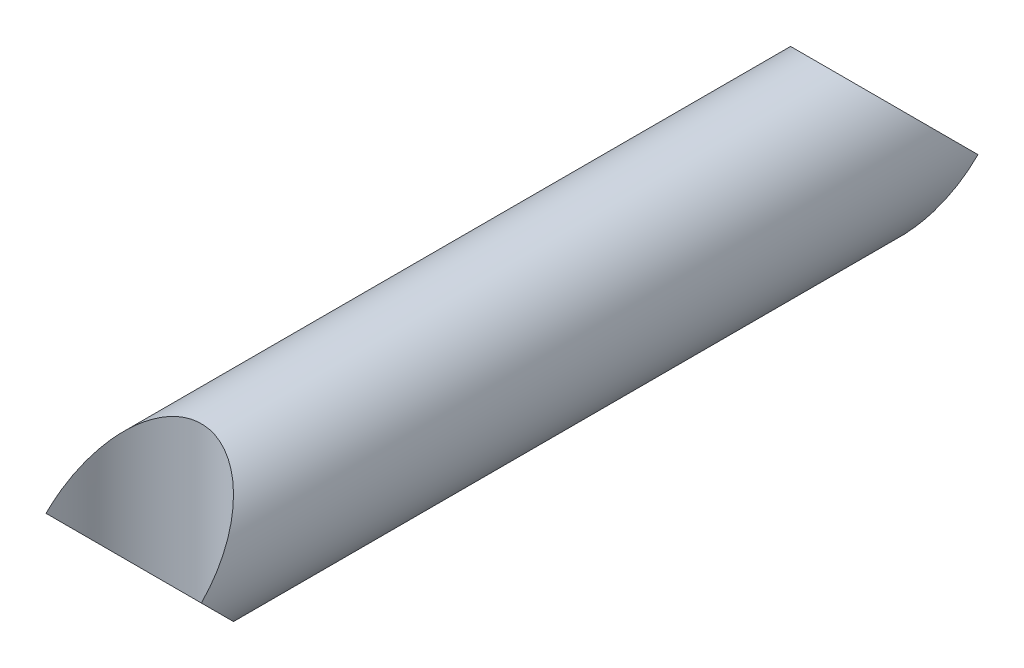
ISO-10303-21;
HEADER;
FILE_DESCRIPTION(('STEP AP214'),'2;1');
FILE_NAME('part.step','',(''),(''),'','','');
FILE_SCHEMA(('AUTOMOTIVE_DESIGN { 1 0 10303 214 1 1 1 1 }'));
ENDSEC;
DATA;
#1=APPLICATION_CONTEXT('core data for automotive mechanical design processes');
#2=APPLICATION_PROTOCOL_DEFINITION('international standard','automotive_design',2000,#1);
#3=PRODUCT_CONTEXT('',#1,'mechanical');
#4=PRODUCT('Part','Part','',(#3));
#5=PRODUCT_RELATED_PRODUCT_CATEGORY('part','',(#4));
#6=PRODUCT_DEFINITION_FORMATION('','',#4);
#7=PRODUCT_DEFINITION_CONTEXT('part definition',#1,'design');
#8=PRODUCT_DEFINITION('design','',#6,#7);
#9=PRODUCT_DEFINITION_SHAPE('','',#8);
#10=(LENGTH_UNIT() NAMED_UNIT(*) SI_UNIT(.MILLI.,.METRE.));
#11=(NAMED_UNIT(*) PLANE_ANGLE_UNIT() SI_UNIT($,.RADIAN.));
#12=(NAMED_UNIT(*) SI_UNIT($,.STERADIAN.) SOLID_ANGLE_UNIT());
#13=UNCERTAINTY_MEASURE_WITH_UNIT(LENGTH_MEASURE(1.E-05),#10,'distance_accuracy_value','');
#14=(GEOMETRIC_REPRESENTATION_CONTEXT(3) GLOBAL_UNCERTAINTY_ASSIGNED_CONTEXT((#13)) GLOBAL_UNIT_ASSIGNED_CONTEXT((#10,
#11,#12)) REPRESENTATION_CONTEXT('',''));
#15=CARTESIAN_POINT('',(0.,0.,0.));
#16=DIRECTION('',(0.,0.,1.));
#17=DIRECTION('',(1.,0.,0.));
#18=AXIS2_PLACEMENT_3D('',#15,#16,#17);
#19=CARTESIAN_POINT('',(0.,0.,0.));
#20=DIRECTION('',(0.,1.,0.));
#21=DIRECTION('',(0.,0.,1.));
#22=AXIS2_PLACEMENT_3D('',#19,#20,#21);
#23=CYLINDRICAL_SURFACE('',#22,25.4);
#24=CARTESIAN_POINT('',(-25.4,0.,0.));
#25=CARTESIAN_POINT('',(-25.3999920544221,-0.401226366646719,0.401039178056689));
#26=CARTESIAN_POINT('',(-25.3904941008682,-0.802374573381763,0.802174230327431));
#27=CARTESIAN_POINT('',(-25.3572330882322,-1.50375810014384,1.50363122073521));
#28=CARTESIAN_POINT('',(-25.3376381064272,-1.80410694524607,1.80404252288148));
#29=CARTESIAN_POINT('',(-25.3077535207798,-2.16359854457294,2.16358607004931));
#30=CARTESIAN_POINT('',(-25.3026090441571,-2.222954405143,2.22294976222645));
#31=CARTESIAN_POINT('',(-25.2719180694074,-2.5631362156659,2.56315818573231));
#32=CARTESIAN_POINT('',(-25.241881759591,-2.84380080800986,2.8437733489418));
#33=CARTESIAN_POINT('',(-25.1646841443686,-3.46666990563632,3.46659554770084));
#34=CARTESIAN_POINT('',(-25.1152026717676,-3.80872509137331,3.80866721001057));
#35=CARTESIAN_POINT('',(-25.0325906082402,-4.30753358355355,4.30751982238383));
#36=CARTESIAN_POINT('',(-25.0050279796697,-4.46476221564417,4.46476528782357));
#37=CARTESIAN_POINT('',(-24.9394746113279,-4.81900420953027,4.81900035427685));
#38=CARTESIAN_POINT('',(-24.9006165716204,-5.01594324617028,5.01590418935291));
#39=CARTESIAN_POINT('',(-24.7799952701596,-5.59119254620094,5.59100429534657));
#40=CARTESIAN_POINT('',(-24.6917778646727,-5.96885819433322,5.96851319571054));
#41=CARTESIAN_POINT('',(-24.5025901339955,-6.7021547341442,6.70162022542667));
#42=CARTESIAN_POINT('',(-24.402526757385,-7.0579060738627,7.05733275363946));
#43=CARTESIAN_POINT('',(-24.1921772225119,-7.74733494871354,7.74684762206255));
#44=CARTESIAN_POINT('',(-24.0827577926573,-8.08114896008624,8.08077754362327));
#45=CARTESIAN_POINT('',(-23.856080737492,-8.72683071210018,8.72669282922222));
#46=CARTESIAN_POINT('',(-23.7396509781816,-9.03884415132987,9.0388233987461));
#47=CARTESIAN_POINT('',(-23.4702742808389,-9.71927307479291,9.7192977611053));
#48=CARTESIAN_POINT('',(-23.3145887680235,-10.0871689449155,10.0870819394219));
#49=CARTESIAN_POINT('',(-22.9903546556834,-10.8052323133036,10.8049647630732));
#50=CARTESIAN_POINT('',(-22.8224885710403,-11.1555546415052,11.155216815527));
#51=CARTESIAN_POINT('',(-22.4756227923025,-11.8383864584989,11.838008511331));
#52=CARTESIAN_POINT('',(-22.2972888999455,-12.1710668494751,12.1707153406947));
#53=CARTESIAN_POINT('',(-21.9311507700362,-12.8186379761997,12.8184177792761));
#54=CARTESIAN_POINT('',(-21.7439959905821,-13.1337133678601,13.1335949147743));
#55=CARTESIAN_POINT('',(-21.454380682475,-13.5978469746312,13.5978223962244));
#56=CARTESIAN_POINT('',(-21.3579735979577,-13.7487899709509,13.7487869905234));
#57=CARTESIAN_POINT('',(-21.1498116500917,-14.0671882009044,14.0671915326823));
#58=CARTESIAN_POINT('',(-21.0375872773712,-14.2344923271426,14.234475724924));
#59=CARTESIAN_POINT('',(-20.6991679044976,-14.7261773214697,14.7260843251318));
#60=CARTESIAN_POINT('',(-20.4662941154893,-15.048285726513,15.0481195650655));
#61=CARTESIAN_POINT('',(-19.989813974462,-15.6753774454176,15.6751194520611));
#62=CARTESIAN_POINT('',(-19.746781924455,-15.9805799324607,15.9803016180997));
#63=CARTESIAN_POINT('',(-19.2512972606937,-16.5738357795373,16.5735952236773));
#64=CARTESIAN_POINT('',(-18.9994056684802,-16.8621243117728,16.8619393145228));
#65=CARTESIAN_POINT('',(-18.4874786399899,-17.4215987627873,17.4215311495354));
#66=CARTESIAN_POINT('',(-18.2279901074098,-17.6930348162483,17.6930287595357));
#67=CARTESIAN_POINT('',(-17.6822006352155,-18.2388233918833,18.2388296939127));
#68=CARTESIAN_POINT('',(-17.3952393999474,-18.5128487447329,18.5128012620619));
#69=CARTESIAN_POINT('',(-16.8120322726002,-19.043810957803,19.0436709360134));
#70=CARTESIAN_POINT('',(-16.5162658817233,-19.3010110718605,19.3008319195626));
#71=CARTESIAN_POINT('',(-15.9165402405606,-19.7982626953444,19.7980599799102));
#72=CARTESIAN_POINT('',(-15.6130418826086,-20.0385926776463,20.0384040295462));
#73=CARTESIAN_POINT('',(-14.9988987629603,-20.5021178631967,20.5019988006219));
#74=CARTESIAN_POINT('',(-14.6886950442086,-20.7256048741087,20.7255401528301));
#75=CARTESIAN_POINT('',(-14.2155006491587,-21.0502993429779,21.0502860074553));
#76=CARTESIAN_POINT('',(-14.0582144391698,-21.1556784752541,21.1556772724818));
#77=CARTESIAN_POINT('',(-13.7382045442355,-21.3648941518918,21.3648953685487));
#78=CARTESIAN_POINT('',(-13.5754390497533,-21.4686988455891,21.468690095118));
#79=CARTESIAN_POINT('',(-13.0874084246316,-21.7721096848621,21.7720614649144));
#80=CARTESIAN_POINT('',(-12.7568751204568,-21.9675175422954,21.9674302502039));
#81=CARTESIAN_POINT('',(-12.08961456149,-22.341533779065,22.3413970834665));
#82=CARTESIAN_POINT('',(-11.7532037258096,-22.5204248488147,22.5202771826104));
#83=CARTESIAN_POINT('',(-11.0750651323274,-22.8614020826823,22.8612735555597));
#84=CARTESIAN_POINT('',(-10.7336261249957,-23.0237752839107,23.0236759500831));
#85=CARTESIAN_POINT('',(-10.0463124266658,-23.3317445907824,23.3317083697096));
#86=CARTESIAN_POINT('',(-9.70069671756104,-23.4776292801617,23.4776268616387));
#87=CARTESIAN_POINT('',(-9.009996183127,-23.7510709377269,23.7510732771573));
#88=CARTESIAN_POINT('',(-8.66526362269101,-23.8790712537856,23.8790465677449));
#89=CARTESIAN_POINT('',(-7.97184532750376,-24.1193312343044,24.1192588230783));
#90=CARTESIAN_POINT('',(-7.62331223109336,-24.2318108616473,24.231717656));
#91=CARTESIAN_POINT('',(-6.92303959437303,-24.4410119310293,24.4409056267678));
#92=CARTESIAN_POINT('',(-6.57142557482194,-24.5379435330003,24.5378445039061));
#93=CARTESIAN_POINT('',(-5.8656919969552,-24.7160728760289,24.7160098721488));
#94=CARTESIAN_POINT('',(-5.51167220596505,-24.7974673811724,24.7974328327563));
#95=CARTESIAN_POINT('',(-4.97776077855498,-24.9081220047168,24.9081148864068));
#96=CARTESIAN_POINT('',(-4.80015345153614,-24.9429629873639,24.9429624743908));
#97=CARTESIAN_POINT('',(-4.45246947550754,-25.0073027857797,25.0073032731464));
#98=CARTESIAN_POINT('',(-4.28245946686129,-25.0369814536734,25.0369769290921));
#99=CARTESIAN_POINT('',(-3.77263338106798,-25.1206167328877,25.1205918379316));
#100=CARTESIAN_POINT('',(-3.43114130100647,-25.1695607257045,25.1695151420188));
#101=CARTESIAN_POINT('',(-2.74686599959355,-25.2533728456722,25.2533008534794));
#102=CARTESIAN_POINT('',(-2.40410309865979,-25.2883243640767,25.2882465622754));
#103=CARTESIAN_POINT('',(-1.71784659861864,-25.3441704706137,25.3441021214582));
#104=CARTESIAN_POINT('',(-1.37436318659347,-25.3651274557104,25.3650742743351));
#105=CARTESIAN_POINT('',(-0.687251006037886,-25.3930221155198,25.3930030116397));
#106=CARTESIAN_POINT('',(-0.343625506355488,-25.4000000000855,25.3999997950156));
#107=CARTESIAN_POINT('',(0.343619556791815,-25.3999999999145,25.4000002049807));
#108=CARTESIAN_POINT('',(0.687239120256489,-25.3930223568071,25.3930040738468));
#109=CARTESIAN_POINT('',(1.37434284785603,-25.3651285233238,25.3650762290606));
#110=CARTESIAN_POINT('',(1.71782373197874,-25.3441719860818,25.344104177292));
#111=CARTESIAN_POINT('',(2.40407859864625,-25.2883267047723,25.2882487365234));
#112=CARTESIAN_POINT('',(2.74684237182303,-25.2533754271025,25.2533029085506));
#113=CARTESIAN_POINT('',(3.43112279403248,-25.1695633069014,25.1695167319931));
#114=CARTESIAN_POINT('',(3.77261908994842,-25.1206189378744,25.1205929484564));
#115=CARTESIAN_POINT('',(4.28245277549438,-25.0369826215059,25.0369775239571));
#116=CARTESIAN_POINT('',(4.4524661405867,-25.0073034029288,25.0073036056407));
#117=CARTESIAN_POINT('',(4.80014990916624,-24.9429636428742,24.94296342952));
#118=CARTESIAN_POINT('',(4.9777537241279,-24.908123388272,24.90811686563));
#119=CARTESIAN_POINT('',(5.51165731120064,-24.7974706265384,24.7974372024359));
#120=CARTESIAN_POINT('',(5.86567275652604,-24.7160773767555,24.7160153578614));
#121=CARTESIAN_POINT('',(6.57140128022728,-24.5379500256386,24.5378514488998));
#122=CARTESIAN_POINT('',(6.92301451928196,-24.441019019657,24.4409127711766));
#123=CARTESIAN_POINT('',(7.62328908777704,-24.2318181839525,24.2317242804373));
#124=CARTESIAN_POINT('',(7.97182481464829,-24.1193380567294,24.1192645915269));
#125=CARTESIAN_POINT('',(8.66525181743968,-23.8790756338059,23.8790500045416));
#126=CARTESIAN_POINT('',(9.00999036663184,-23.7510732404542,23.7510751171234));
#127=CARTESIAN_POINT('',(9.70069059057685,-23.4776317057411,23.4776297656917));
#128=CARTESIAN_POINT('',(10.0463003672503,-23.3317496775728,23.3317143967003));
#129=CARTESIAN_POINT('',(10.7336058281815,-23.0237847022503,23.0236864109878));
#130=CARTESIAN_POINT('',(11.0750424096443,-22.8614130452328,22.8612851828392));
#131=CARTESIAN_POINT('',(11.7531796990697,-22.5204374031336,22.5202896335542));
#132=CARTESIAN_POINT('',(12.08959153162,-22.3415462565071,22.3414090675926));
#133=CARTESIAN_POINT('',(12.7568573465761,-21.9675279464625,21.9674396498875));
#134=CARTESIAN_POINT('',(13.0873947784563,-21.7721179715641,21.7720686327002));
#135=CARTESIAN_POINT('',(13.5754327411422,-21.4687028680504,21.4686935261471));
#136=CARTESIAN_POINT('',(13.738201425807,-21.3648961906494,21.3648971139815));
#137=CARTESIAN_POINT('',(14.0582112359889,-21.1556805694304,21.1556796566716));
#138=CARTESIAN_POINT('',(14.2154943149576,-21.0503035859205,21.0502908266149));
#139=CARTESIAN_POINT('',(14.6886818444298,-20.7256141428024,20.7255505221458));
#140=CARTESIAN_POINT('',(14.998881815644,-20.5021301737688,20.5020120883991));
#141=CARTESIAN_POINT('',(15.6130208343546,-20.0386090581945,20.0384209087367));
#142=CARTESIAN_POINT('',(15.9165186849252,-19.7982800050373,19.7980774269401));
#143=CARTESIAN_POINT('',(16.5162463448129,-19.301027849462,19.3008481478163));
#144=CARTESIAN_POINT('',(16.812015102917,-19.0438261771365,19.0436852824773));
#145=CARTESIAN_POINT('',(17.3952297372709,-18.5128579658158,18.5128096771047));
#146=CARTESIAN_POINT('',(17.6821959524479,-18.2388280744027,18.2388339815293));
#147=CARTESIAN_POINT('',(18.227985368191,-17.6930395556903,17.6930338787045));
#148=CARTESIAN_POINT('',(18.4874694390579,-17.4216083821967,17.4215415172386));
#149=CARTESIAN_POINT('',(18.9993905325288,-16.8621413045566,16.8619571654033));
#150=CARTESIAN_POINT('',(19.2512804854731,-16.5738552003355,16.5736152219644));
#151=CARTESIAN_POINT('',(19.7467645854746,-15.9806013796684,15.9803230734865));
#152=CARTESIAN_POINT('',(19.9897975442268,-15.6753984207215,15.6751401476806));
#153=CARTESIAN_POINT('',(20.4662817692704,-15.0483026448341,15.0481358186566));
#154=CARTESIAN_POINT('',(20.6991585607657,-14.7261905851126,14.7260968338971));
#155=CARTESIAN_POINT('',(21.0375830374797,-14.23449864682,14.2344816412116));
#156=CARTESIAN_POINT('',(21.1498095750852,-14.0671913747463,14.0671945067346));
#157=CARTESIAN_POINT('',(21.357971565744,-13.7487930793864,13.7487902777905));
#158=CARTESIAN_POINT('',(21.4543766949187,-13.5978532169786,13.5978289946591));
#159=CARTESIAN_POINT('',(21.7439878233426,-13.1337267620585,13.1336089987671));
#160=CARTESIAN_POINT('',(21.9311404408376,-12.8186555169402,12.8184359437065));
#161=CARTESIAN_POINT('',(22.2972764690322,-12.1710895932422,12.1707384424045));
#162=CARTESIAN_POINT('',(22.4756102627303,-11.8384102158346,11.8380324224707));
#163=CARTESIAN_POINT('',(22.8224776255333,-11.1555771324992,11.1552390720406));
#164=CARTESIAN_POINT('',(22.9903452255652,-10.8052524804741,10.8049845136734));
#165=CARTESIAN_POINT('',(23.3145837103588,-10.0871808902602,10.0870934795914));
#166=CARTESIAN_POINT('',(23.470271905405,-9.71927907485156,9.71930356438234));
#167=CARTESIAN_POINT('',(23.7396487297619,-9.03884983081756,9.03882924436888));
#168=CARTESIAN_POINT('',(23.8560764792206,-8.72684211877108,8.72670456660897));
#169=CARTESIAN_POINT('',(24.0827511277337,-8.08116871237553,8.08079769379407));
#170=CARTESIAN_POINT('',(24.1921700267753,-7.74735730399484,7.74687026115021));
#171=CARTESIAN_POINT('',(24.402519760985,-7.05793030542051,7.05735706016708));
#172=CARTESIAN_POINT('',(24.5025837219882,-6.70217821415256,6.70164368881527));
#173=CARTESIAN_POINT('',(24.6917734273057,-5.96887684228171,5.96853162910108));
#174=CARTESIAN_POINT('',(24.7799920615839,-5.59120709429559,5.59101852299903));
#175=CARTESIAN_POINT('',(24.9006152319549,-5.01595002676447,5.0159108948844));
#176=CARTESIAN_POINT('',(24.9394740015835,-4.81900748897921,4.81900371471388));
#177=CARTESIAN_POINT('',(25.0050268983043,-4.46476807158046,4.4647710790598));
#178=CARTESIAN_POINT('',(25.0325885318964,-4.30754545013485,4.307531411203));
#179=CARTESIAN_POINT('',(25.1151998989604,-3.80874328800521,3.80868626667207));
#180=CARTESIAN_POINT('',(25.1646819843244,-3.46668623790526,3.46661621427589));
#181=CARTESIAN_POINT('',(25.2418795767537,-2.84381931701471,2.84378826144852));
#182=CARTESIAN_POINT('',(25.2719153593183,-2.56315613858513,2.56316569402689));
#183=CARTESIAN_POINT('',(25.3296804930779,-1.92290472323423,1.92289249547965));
#184=CARTESIAN_POINT('',(25.3544156616708,-1.56319520228275,1.56308859721084));
#185=CARTESIAN_POINT('',(25.3904919203196,-0.802392367637315,0.80217641492752));
#186=CARTESIAN_POINT('',(25.3999876104842,-0.401249725766488,0.401029065841664));
#187=CARTESIAN_POINT('',(25.4,0.,0.));
#188=B_SPLINE_CURVE_WITH_KNOTS('',3,(#24,#25,#26,#27,#28,#29,#30,#31,#32,#33,#34,#35,#36,#37,
#38,#39,#40,#41,#42,#43,#44,#45,#46,#47,#48,#49,#50,#51,#52,#53,#54,#55,#56,#57,#58,#59,#60,#61,
#62,#63,#64,#65,#66,#67,#68,#69,#70,#71,#72,#73,#74,#75,#76,#77,#78,#79,#80,#81,#82,#83,#84,#85,
#86,#87,#88,#89,#90,#91,#92,#93,#94,#95,#96,#97,#98,#99,#100,#101,#102,#103,#104,#105,#106,#107,
#108,#109,#110,#111,#112,#113,#114,#115,#116,#117,#118,#119,#120,#121,#122,#123,#124,#125,#126,
#127,#128,#129,#130,#131,#132,#133,#134,#135,#136,#137,#138,#139,#140,#141,#142,#143,#144,#145,
#146,#147,#148,#149,#150,#151,#152,#153,#154,#155,#156,#157,#158,#159,#160,#161,#162,#163,#164,
#165,#166,#167,#168,#169,#170,#171,#172,#173,#174,#175,#176,#177,#178,#179,#180,#181,#182,#183,
#184,#185,#186,#187),.UNSPECIFIED.,.F.,.F.,(4,2,2,2,2,2,2,2,2,2,2,2,2,2,2,2,2,2,2,2,2,2,2,2,2,2,
2,2,2,2,2,2,2,2,2,2,2,2,2,2,2,2,2,2,2,2,2,2,2,2,2,2,2,2,2,2,2,2,2,2,2,2,2,2,2,2,2,2,2,2,2,2,2,2,
2,2,2,2,2,2,2,4),(0.,1.70179878460543,2.97741601134251,3.22973056918352,4.42367138610336,
5.88226719163596,6.55445590346961,7.39798015703908,9.02133552412731,10.5598876046845,
12.013690104342,13.3828069028239,15.0114448281328,16.5802615763926,18.0894418868126,
19.5391933408775,20.2418822757525,21.0274083148395,22.5616352518738,24.0472231500794,
25.4846384670989,26.8743961809247,28.3204436965788,29.7263132890715,31.092840604397,
32.4209355580073,33.0709247923643,33.7284174683614,35.020272086095,36.2824680466236,
37.5163379897057,38.7233083856976,39.8908074939667,41.0395382596947,42.1711219504659,
43.2872545588018,43.8401351843384,44.365417460784,45.4101150360922,46.4484903518031,
47.482204422146,48.5129407961542,49.5436593238979,50.5773657310422,51.6157436019079,
52.6604539364142,53.1857464015395,53.7386158813532,54.854734533448,55.9863154299089,
57.1350545751155,58.3025732005432,59.5095220385962,60.7433827288704,62.0055817745463,
63.2974518062951,63.9549568010057,64.604932530369,65.9330105892657,67.2995345237732,
68.7054142574681,70.1514854194877,71.5412178517152,72.9786223283838,74.4642138404631,
75.998458843348,76.7839993324185,77.4866733940747,78.9364062544267,80.4455828456241,
82.0144107513962,83.6430747075874,85.0121661448686,86.4659577747627,88.0045134786166,
89.6278869617365,90.4714257091774,91.143589733006,92.6021784853735,93.7961510426243,
95.324034714158,97.0258575972684),.UNSPECIFIED.);
#189=CARTESIAN_POINT('',(-25.4,0.,0.));
#190=VERTEX_POINT('',#189);
#191=CARTESIAN_POINT('',(25.4,0.,0.));
#192=VERTEX_POINT('',#191);
#193=EDGE_CURVE('E40',#190,#192,#188,.T.);
#194=ORIENTED_EDGE('',*,*,#193,.F.);
#195=CARTESIAN_POINT('',(25.4,0.,0.));
#196=CARTESIAN_POINT('',(25.3999920544238,0.401226363266249,0.401039174707697));
#197=CARTESIAN_POINT('',(25.3904941010281,0.802374566649201,0.802174223601833));
#198=CARTESIAN_POINT('',(25.3572330887337,1.50375809208906,1.50363121265583));
#199=CARTESIAN_POINT('',(25.3376381068805,1.80410693921546,1.80404251681745));
#200=CARTESIAN_POINT('',(25.3077535210122,2.16359854189143,2.16358606735792));
#201=CARTESIAN_POINT('',(25.302609044278,2.22295440380238,2.22294976088103));
#202=CARTESIAN_POINT('',(25.271918069579,2.56313621376462,2.56315818385304));
#203=CARTESIAN_POINT('',(25.2418817599978,2.84380080421113,2.84377334518474));
#204=CARTESIAN_POINT('',(25.1646841450988,3.46666990037707,3.46659554248614));
#205=CARTESIAN_POINT('',(25.1152026725048,3.8087250865505,3.8086672052072));
#206=CARTESIAN_POINT('',(25.0325906087531,4.3075335806282,4.30751981946052));
#207=CARTESIAN_POINT('',(25.00502797994,4.46476221418357,4.46476528636242));
#208=CARTESIAN_POINT('',(24.9394746113053,4.81900420965243,4.81900035439972));
#209=CARTESIAN_POINT('',(24.9006165715728,5.01594324641162,5.01590418960113));
#210=CARTESIAN_POINT('',(24.7799952700474,5.59119254670869,5.59100429587677));
#211=CARTESIAN_POINT('',(24.6917778645166,5.96885819498889,5.96851319639575));
#212=CARTESIAN_POINT('',(24.5025901337693,6.70215473497277,6.70162022629761));
#213=CARTESIAN_POINT('',(24.4025267571383,7.05790607471701,7.05733275454188));
#214=CARTESIAN_POINT('',(24.1921772222585,7.74733494950085,7.74684762290359));
#215=CARTESIAN_POINT('',(24.0827577924228,8.0811489607815,8.08077754437239));
#216=CARTESIAN_POINT('',(23.8560807373421,8.72683071250178,8.72669282965858));
#217=CARTESIAN_POINT('',(23.7396509781023,9.03884415153019,9.03882339896308));
#218=CARTESIAN_POINT('',(23.4702742806743,9.71927307520856,9.71929776150116));
#219=CARTESIAN_POINT('',(23.3145887676736,10.0871689457419,10.0870819402103));
#220=CARTESIAN_POINT('',(22.9903546550313,10.8052323146983,10.8049647644232));
#221=CARTESIAN_POINT('',(22.8224885702833,11.1555546430605,11.1552168170482));
#222=CARTESIAN_POINT('',(22.4756227914361,11.8383864601418,11.8380085129654));
#223=CARTESIAN_POINT('',(22.2972888990859,12.1710668510479,12.1707153422739));
#224=CARTESIAN_POINT('',(21.9311507693218,12.8186379774129,12.8184177805173));
#225=CARTESIAN_POINT('',(21.7439959900169,13.133713368787,13.1335949157361));
#226=CARTESIAN_POINT('',(21.4543806821994,13.5978469750627,13.5978223966756));
#227=CARTESIAN_POINT('',(21.3579735978175,13.7487899711654,13.7487869907487));
#228=CARTESIAN_POINT('',(21.1498116501156,14.0671882008679,14.0671915326336));
#229=CARTESIAN_POINT('',(21.0375872774192,14.234492327071,14.2344757248256));
#230=CARTESIAN_POINT('',(20.6991679046015,14.7261773213223,14.7260843249191));
#231=CARTESIAN_POINT('',(20.4662941156275,15.0482857263234,15.0481195647915));
#232=CARTESIAN_POINT('',(19.9898139746472,15.6753774451812,15.6751194517142));
#233=CARTESIAN_POINT('',(19.7467819246503,15.980579932219,15.9803016177401));
#234=CARTESIAN_POINT('',(19.2512972608823,16.573835779319,16.5735952233411));
#235=CARTESIAN_POINT('',(18.9994056686495,16.8621243115825,16.8619393142215));
#236=CARTESIAN_POINT('',(18.4874786400928,17.4215987626798,17.4215311493596));
#237=CARTESIAN_POINT('',(18.2279901074631,17.693034816195,17.6930287594489));
#238=CARTESIAN_POINT('',(17.6822006353421,18.2388233917566,18.2388296938209));
#239=CARTESIAN_POINT('',(17.3952394002081,18.5128487444841,18.5128012618817));
#240=CARTESIAN_POINT('',(16.8120322730623,19.0438109573933,19.0436709357051));
#241=CARTESIAN_POINT('',(16.5162658822489,19.3010110714092,19.3008319192128));
#242=CARTESIAN_POINT('',(15.9165402411399,19.7982626948791,19.7980599795335));
#243=CARTESIAN_POINT('',(15.6130418831743,20.0385926772061,20.0384040291818));
#244=CARTESIAN_POINT('',(14.9988987634164,20.5021178628653,20.5019988003366));
#245=CARTESIAN_POINT('',(14.6886950445649,20.7256048738586,20.7255401526091));
#246=CARTESIAN_POINT('',(14.2155006493286,21.0502993428641,21.0502860073508));
#247=CARTESIAN_POINT('',(14.0582144392553,21.1556784751982,21.1556772724294));
#248=CARTESIAN_POINT('',(13.7382045441427,21.3648941519525,21.3648953686058));
#249=CARTESIAN_POINT('',(13.5754390495665,21.4686988457082,21.4686900952323));
#250=CARTESIAN_POINT('',(13.0874084242291,21.7721096851065,21.7720614651567));
#251=CARTESIAN_POINT('',(12.7568751199318,21.9675175426028,21.9674302505196));
#252=CARTESIAN_POINT('',(12.0896145608089,22.341533779434,22.3413970838676));
#253=CARTESIAN_POINT('',(11.7532037250991,22.520424849186,22.5202771830271));
#254=CARTESIAN_POINT('',(11.0750651316555,22.8614020830064,22.8612735559493));
#255=CARTESIAN_POINT('',(10.7336261243957,23.0237752841892,23.0236759504338));
#256=CARTESIAN_POINT('',(10.0463124263094,23.3317445909328,23.3317083699125));
#257=CARTESIAN_POINT('',(9.70069671737996,23.4776292802334,23.4776268617374));
#258=CARTESIAN_POINT('',(9.00999618297573,23.7510709377868,23.7510732771911));
#259=CARTESIAN_POINT('',(8.66526362238398,23.8790712538995,23.8790465678054));
#260=CARTESIAN_POINT('',(7.97184532697079,24.1193312344817,24.1192588231793));
#261=CARTESIAN_POINT('',(7.62331223049237,24.2318108618374,24.2317176561179));
#262=CARTESIAN_POINT('',(6.92303959372226,24.4410119312133,24.4409056268958));
#263=CARTESIAN_POINT('',(6.57142557419145,24.5379435331688,24.5378445040308));
#264=CARTESIAN_POINT('',(5.8656919964558,24.7160728761458,24.7160098722463));
#265=CARTESIAN_POINT('',(5.51167220557828,24.7974673812567,24.7974328328335));
#266=CARTESIAN_POINT('',(4.97776077837211,24.9081220047526,24.9081148864427));
#267=CARTESIAN_POINT('',(4.80015345144444,24.9429629873809,24.9429624744083));
#268=CARTESIAN_POINT('',(4.45246947550158,25.0073027857808,25.007303273147));
#269=CARTESIAN_POINT('',(4.28245946684916,25.0369814536755,25.0369769290922));
#270=CARTESIAN_POINT('',(3.77263338104189,25.1206167328917,25.1205918379306));
#271=CARTESIAN_POINT('',(3.43114130097278,25.1695607257092,25.1695151420183));
#272=CARTESIAN_POINT('',(2.7468659995506,25.2533728456769,25.2533008534791));
#273=CARTESIAN_POINT('',(2.40410309861526,25.2883243640809,25.2882465622752));
#274=CARTESIAN_POINT('',(1.71784659857707,25.3441704706164,25.3441021214579));
#275=CARTESIAN_POINT('',(1.3743631865565,25.3651274557123,25.3650742743349));
#276=CARTESIAN_POINT('',(0.687251006016288,25.3930221155203,25.3930030116397));
#277=CARTESIAN_POINT('',(0.343625506344687,25.4000000000855,25.3999997950158));
#278=CARTESIAN_POINT('',(-0.343619556763471,25.3999999999145,25.4000002049805));
#279=CARTESIAN_POINT('',(-0.687239120199795,25.3930223568083,25.3930040738464));
#280=CARTESIAN_POINT('',(-1.37434284775896,25.3651285233289,25.3650762290603));
#281=CARTESIAN_POINT('',(-1.71782373186959,25.344171986089,25.3441041772913));
#282=CARTESIAN_POINT('',(-2.40407859852929,25.2883267047835,25.2882487365228));
#283=CARTESIAN_POINT('',(-2.74684237171023,25.2533754271149,25.2533029085498));
#284=CARTESIAN_POINT('',(-3.43112279394402,25.1695633069137,25.1695167319919));
#285=CARTESIAN_POINT('',(-3.77261908987998,25.120618937885,25.1205929484543));
#286=CARTESIAN_POINT('',(-4.28245277546247,25.0369826215115,25.0369775239572));
#287=CARTESIAN_POINT('',(-4.45246614057091,25.0073034029317,25.0073036056416));
#288=CARTESIAN_POINT('',(-4.80014990902189,24.9429636429009,24.9429634295489));
#289=CARTESIAN_POINT('',(-4.97775372384006,24.9081233883284,24.908116865689));
#290=CARTESIAN_POINT('',(-5.51165731059196,24.797470626671,24.7974372025633));
#291=CARTESIAN_POINT('',(-5.86567275574009,24.7160773769393,24.7160153580222));
#292=CARTESIAN_POINT('',(-6.57140127923502,24.5379500259037,24.5378514491052));
#293=CARTESIAN_POINT('',(-6.92301451825779,24.4410190199466,24.4409127713876));
#294=CARTESIAN_POINT('',(-7.62328908683133,24.2318181842517,24.2317242806318));
#295=CARTESIAN_POINT('',(-7.97182481380969,24.1193380570084,24.1192645916942));
#296=CARTESIAN_POINT('',(-8.66525181695653,23.8790756339851,23.8790500046413));
#297=CARTESIAN_POINT('',(-9.00999036639356,23.7510732405485,23.7510751171781));
#298=CARTESIAN_POINT('',(-9.70069059035269,23.4776317058299,23.4776297658214));
#299=CARTESIAN_POINT('',(-10.0463003668096,23.3317496777586,23.3317143969678));
#300=CARTESIAN_POINT('',(-10.7336058274399,23.0237847025945,23.0236864114497));
#301=CARTESIAN_POINT('',(-11.0750424088134,22.8614130456336,22.861285183352));
#302=CARTESIAN_POINT('',(-11.753179698191,22.5204374035927,22.5202896341025));
#303=CARTESIAN_POINT('',(-12.0895915307779,22.3415462569634,22.3414090681205));
#304=CARTESIAN_POINT('',(-12.756857345927,21.9675279468425,21.9674396503032));
#305=CARTESIAN_POINT('',(-13.0873947779588,21.7721179718662,21.7720686330194));
#306=CARTESIAN_POINT('',(-13.5754327409113,21.4687028681976,21.4686935262975));
#307=CARTESIAN_POINT('',(-13.7382014256926,21.3648961907242,21.3648971140571));
#308=CARTESIAN_POINT('',(-14.0582112359886,21.1556805694306,21.155679656671));
#309=CARTESIAN_POINT('',(-14.2154943149574,21.0503035859206,21.0502908266147));
#310=CARTESIAN_POINT('',(-14.68868184443,20.7256141428023,20.7255505221462));
#311=CARTESIAN_POINT('',(-14.998881815644,20.5021301737688,20.5020120883992));
#312=CARTESIAN_POINT('',(-15.6130208343546,20.0386090581945,20.0384209087366));
#313=CARTESIAN_POINT('',(-15.9165186849253,19.7982800050372,19.7980774269403));
#314=CARTESIAN_POINT('',(-16.5162463448128,19.3010278494621,19.3008481478162));
#315=CARTESIAN_POINT('',(-16.8120151029166,19.043826177137,19.0436852824765));
#316=CARTESIAN_POINT('',(-17.3952297372713,18.5128579658154,18.5128096771056));
#317=CARTESIAN_POINT('',(-17.6821959524496,18.2388280744011,18.2388339815325));
#318=CARTESIAN_POINT('',(-18.2279853679103,17.693039555971,17.6930338789805));
#319=CARTESIAN_POINT('',(-18.4874694385105,17.4216083827691,17.4215415177938));
#320=CARTESIAN_POINT('',(-18.9993905316276,16.8621413055681,16.8619571663589));
#321=CARTESIAN_POINT('',(-19.2512804844755,16.5738552014905,16.5736152230369));
#322=CARTESIAN_POINT('',(-19.7467645844441,15.9806013809431,15.9803230746386));
#323=CARTESIAN_POINT('',(-19.9897975432503,15.6753984219682,15.6751401487918));
#324=CARTESIAN_POINT('',(-20.4662817685356,15.0483026458409,15.0481358195275));
#325=CARTESIAN_POINT('',(-20.6991585602088,14.7261905859033,14.7260968345653));
#326=CARTESIAN_POINT('',(-21.037583037228,14.2344986471951,14.2344816415301));
#327=CARTESIAN_POINT('',(-21.1498095749625,14.067191374934,14.0671945068959));
#328=CARTESIAN_POINT('',(-21.3579715653936,13.7487930799225,13.7487902783503));
#329=CARTESIAN_POINT('',(-21.4543766942303,13.5978532180563,13.5978289957813));
#330=CARTESIAN_POINT('',(-21.7439878219312,13.1337267643731,13.1336090011593));
#331=CARTESIAN_POINT('',(-21.9311404390534,12.8186555199701,12.8184359467935));
#332=CARTESIAN_POINT('',(-22.2972764668855,12.1710895971698,12.1707384463321));
#333=CARTESIAN_POINT('',(-22.4756102605667,11.838410219937,11.8380324265361));
#334=CARTESIAN_POINT('',(-22.8224776236428,11.1555771363838,11.1552390758237));
#335=CARTESIAN_POINT('',(-22.990345223936,10.8052524839584,10.8049845170293));
#336=CARTESIAN_POINT('',(-23.3145837094854,10.0871808923227,10.0870934815537));
#337=CARTESIAN_POINT('',(-23.4702719049961,9.71927907588423,9.71930356537292));
#338=CARTESIAN_POINT('',(-23.7396487289854,9.03884983277923,9.03882924636615));
#339=CARTESIAN_POINT('',(-23.8560764777484,8.72684212271525,8.72670457061471));
#340=CARTESIAN_POINT('',(-24.082751125429,8.08116871920518,8.08079770066982));
#341=CARTESIAN_POINT('',(-24.192170024288,7.74735731172141,7.74687026887723));
#342=CARTESIAN_POINT('',(-24.4025197585662,7.05793031379865,7.05735706846428));
#343=CARTESIAN_POINT('',(-24.5025837197705,6.70217822227691,6.70164369682425));
#344=CARTESIAN_POINT('',(-24.6917734257729,5.96887684872054,5.96853163539262));
#345=CARTESIAN_POINT('',(-24.7799920604797,5.59120709929415,5.59101852785528));
#346=CARTESIAN_POINT('',(-24.9006152314891,5.01595002912466,5.01591089717301));
#347=CARTESIAN_POINT('',(-24.9394740013648,4.81900749016082,4.8190037158593));
#348=CARTESIAN_POINT('',(-25.0050268984168,4.46476807097263,4.46477107848083));
#349=CARTESIAN_POINT('',(-25.0325885321097,4.30754544891783,4.30753141004427));
#350=CARTESIAN_POINT('',(-25.1151998992694,3.80874328598466,3.8086862647826));
#351=CARTESIAN_POINT('',(-25.1646819846297,3.46668623570271,3.46661621222361));
#352=CARTESIAN_POINT('',(-25.2418795769232,2.84381931543389,2.84378825995984));
#353=CARTESIAN_POINT('',(-25.2719153593893,2.56315613780153,2.56316569327484));
#354=CARTESIAN_POINT('',(-25.3296804936815,1.92290471654034,1.92289248874509));
#355=CARTESIAN_POINT('',(-25.3544156625937,1.56319518885936,1.56308858375011));
#356=CARTESIAN_POINT('',(-25.3904919206391,0.802392354182075,0.802176401468014));
#357=CARTESIAN_POINT('',(-25.3999876104867,0.401249719024789,0.401029059124405));
#358=CARTESIAN_POINT('',(-25.4,0.,0.));
#359=B_SPLINE_CURVE_WITH_KNOTS('',3,(#195,#196,#197,#198,#199,#200,#201,#202,#203,#204,#205,
#206,#207,#208,#209,#210,#211,#212,#213,#214,#215,#216,#217,#218,#219,#220,#221,#222,#223,#224,
#225,#226,#227,#228,#229,#230,#231,#232,#233,#234,#235,#236,#237,#238,#239,#240,#241,#242,#243,
#244,#245,#246,#247,#248,#249,#250,#251,#252,#253,#254,#255,#256,#257,#258,#259,#260,#261,#262,
#263,#264,#265,#266,#267,#268,#269,#270,#271,#272,#273,#274,#275,#276,#277,#278,#279,#280,#281,
#282,#283,#284,#285,#286,#287,#288,#289,#290,#291,#292,#293,#294,#295,#296,#297,#298,#299,#300,
#301,#302,#303,#304,#305,#306,#307,#308,#309,#310,#311,#312,#313,#314,#315,#316,#317,#318,#319,
#320,#321,#322,#323,#324,#325,#326,#327,#328,#329,#330,#331,#332,#333,#334,#335,#336,#337,#338,
#339,#340,#341,#342,#343,#344,#345,#346,#347,#348,#349,#350,#351,#352,#353,#354,#355,#356,#357,
#358),.UNSPECIFIED.,.F.,.F.,(4,2,2,2,2,2,2,2,2,2,2,2,2,2,2,2,2,2,2,2,2,2,2,2,2,2,2,2,2,2,2,2,2,
2,2,2,2,2,2,2,2,2,2,2,2,2,2,2,2,2,2,2,2,2,2,2,2,2,2,2,2,2,2,2,2,2,2,2,2,2,2,2,2,2,2,2,2,2,2,2,2,
4),(0.,1.70179877033373,2.97741600563434,3.22973056918481,4.42367137806844,5.88226718538682,
6.55445590347123,7.39798015756481,9.02133552530805,10.5598876059962,12.0136901052608,
13.3828069028262,15.0114448299258,16.5802615789532,18.0894418891173,19.5391933419029,
20.2418822757545,21.0274083146476,22.5616352514399,24.0472231495973,25.484638466761,
26.8743961809218,28.3204436959782,29.7263132882139,31.0928406036253,32.4209355576656,
33.0709247923669,33.7284174687377,35.0202720869384,36.2824680475604,37.5163379903629,
38.7233083857045,39.8908074944666,41.0395382604069,42.171121951107,43.2872545590874,
43.8401351843392,44.365417460803,45.4101150361342,46.4484903518497,47.4822044221788,
48.5129407961546,49.5436593238132,50.5773657309212,51.615743601799,52.6604539363654,
53.1857464015386,53.7386158809036,54.8547345324374,55.9863154287865,57.135054574328,
58.3025732005339,59.5095220377738,60.7433827276982,62.005581773491,63.2974518058252,
63.9549568010045,64.6049325303677,65.9330105892645,67.2995345237719,68.7054142574669,
70.1514854194865,71.5412178502637,72.978622326311,74.4642138385973,75.9984588425159,
76.7839993324127,77.4866733915176,78.9364062486804,80.4455828392398,82.0144107469254,
83.6430747075805,85.012166136147,86.4659577623062,88.004513467405,89.6278869567493,
90.47142570917,91.1435897355386,92.6021784886316,93.7961510426173,95.3240347426929,
97.0258575972621),.UNSPECIFIED.);
#360=EDGE_CURVE('E43',#192,#190,#359,.T.);
#361=ORIENTED_EDGE('',*,*,#360,.F.);
#362=EDGE_LOOP('',(#194,#361));
#363=FACE_BOUND('',#362,.T.);
#364=ADVANCED_FACE('F17',(#363),#23,.F.);
#365=CARTESIAN_POINT('',(0.,0.,254.));
#366=DIRECTION('',(0.,1.,0.));
#367=DIRECTION('',(0.,0.,1.));
#368=AXIS2_PLACEMENT_3D('',#365,#366,#367);
#369=CYLINDRICAL_SURFACE('',#368,25.4);
#370=CARTESIAN_POINT('',(0.,0.,254.));
#371=DIRECTION('',(0.,0.707106781186547,0.707106781186547));
#372=DIRECTION('',(0.,0.707106781186547,-0.707106781186547));
#373=AXIS2_PLACEMENT_3D('',#370,#371,#372);
#374=ELLIPSE('',#373,35.9210244842766,25.4);
#375=CARTESIAN_POINT('',(-25.4,0.,254.));
#376=VERTEX_POINT('',#375);
#377=CARTESIAN_POINT('',(25.4,0.,254.));
#378=VERTEX_POINT('',#377);
#379=EDGE_CURVE('E11',#376,#378,#374,.F.);
#380=ORIENTED_EDGE('',*,*,#379,.F.);
#381=CARTESIAN_POINT('',(25.4,0.,254.));
#382=CARTESIAN_POINT('',(25.3999920544338,-0.401226343417553,253.598960844951));
#383=CARTESIAN_POINT('',(25.3904941019672,-0.802374527122536,253.197825815882));
#384=CARTESIAN_POINT('',(25.3572330916777,-1.50375804480183,252.496368834777));
#385=CARTESIAN_POINT('',(25.3376381095413,-1.80410690381238,252.195957518785));
#386=CARTESIAN_POINT('',(25.3077535223767,-2.16359852614855,251.836413948442));
#387=CARTESIAN_POINT('',(25.3026090449882,-2.22295439593122,251.777050247017));
#388=CARTESIAN_POINT('',(25.2719180717812,-2.56313618935483,251.436841840435));
#389=CARTESIAN_POINT('',(25.2418817652177,-2.84380075545322,251.156226703385));
#390=CARTESIAN_POINT('',(25.1646841544662,-3.46666983291065,250.533404524966));
#391=CARTESIAN_POINT('',(25.1152026819584,-3.80872502469484,250.191332856937));
#392=CARTESIAN_POINT('',(25.0325906153374,-4.30753354307252,249.692480218323));
#393=CARTESIAN_POINT('',(25.00502798341,-4.46476219543227,249.535234732523));
#394=CARTESIAN_POINT('',(24.9394746121604,-4.8190042050314,249.180999650053));
#395=CARTESIAN_POINT('',(24.9006165734018,-5.01594323714413,248.984095819257));
#396=CARTESIAN_POINT('',(24.7799952743916,-5.59119252703942,248.408995722875));
#397=CARTESIAN_POINT('',(24.6917778705436,-5.96885816967249,248.031486827919));
#398=CARTESIAN_POINT('',(24.502590142485,-6.70215470304401,247.298379804671));
#399=CARTESIAN_POINT('',(24.402526766645,-7.05790604178863,246.942667277538));
#400=CARTESIAN_POINT('',(24.1921772320359,-7.74733491912734,246.253152406965));
#401=CARTESIAN_POINT('',(24.0827578014852,-8.08114893392777,245.919222482199));
#402=CARTESIAN_POINT('',(23.8560807431298,-8.72683069699477,245.273307185823));
#403=CARTESIAN_POINT('',(23.739650981153,-9.03884414382352,244.961176608762));
#404=CARTESIAN_POINT('',(23.4702742810293,-9.71927307431264,244.280702239373));
#405=CARTESIAN_POINT('',(23.314588768448,-10.087168943914,243.912918061479));
#406=CARTESIAN_POINT('',(22.9903546564813,-10.8052323115959,243.195035238449));
#407=CARTESIAN_POINT('',(22.8224885719638,-11.1555546396073,242.844783186196));
#408=CARTESIAN_POINT('',(22.4756227933577,-11.8383864564985,242.161991490525));
#409=CARTESIAN_POINT('',(22.2972889009931,-12.1710668475587,241.829284661097));
#410=CARTESIAN_POINT('',(21.9311507709076,-12.8186379747195,241.18158222213));
#411=CARTESIAN_POINT('',(21.7439959912723,-13.1337133667284,240.866405086314));
#412=CARTESIAN_POINT('',(21.4543806828107,-13.5978469741057,240.402177604288));
#413=CARTESIAN_POINT('',(21.3579735981286,-13.7487899706896,240.251213009732));
#414=CARTESIAN_POINT('',(21.1498116501246,-14.067188200854,239.932808467375));
#415=CARTESIAN_POINT('',(21.037587277439,-14.2344923270415,239.765524275188));
#416=CARTESIAN_POINT('',(20.6991679046468,-14.726177321258,239.273915675107));
#417=CARTESIAN_POINT('',(20.4662941156865,-15.0482857262426,238.951880435245));
#418=CARTESIAN_POINT('',(19.9898139747251,-15.6753774450818,238.324880548333));
#419=CARTESIAN_POINT('',(19.7467819247329,-15.9805799321169,238.019698382308));
#420=CARTESIAN_POINT('',(19.2512972609617,-16.5738357792269,237.426404776704));
#421=CARTESIAN_POINT('',(18.9994056687206,-16.8621243115026,237.138060685821));
#422=CARTESIAN_POINT('',(18.487478640138,-17.4215987626326,236.57846885066));
#423=CARTESIAN_POINT('',(18.2279901074902,-17.693034816168,236.306971240553));
#424=CARTESIAN_POINT('',(17.6822006361707,-18.238823390928,235.761170307034));
#425=CARTESIAN_POINT('',(17.3952394019088,-18.5128487428606,235.487198739819));
#426=CARTESIAN_POINT('',(16.8120322760852,-19.0438109547144,234.956329067198));
#427=CARTESIAN_POINT('',(16.5162658856916,-19.3010110684526,234.699168084063));
#428=CARTESIAN_POINT('',(15.9165402449413,-19.7982626918265,234.201940023984));
#429=CARTESIAN_POINT('',(15.6130418868852,-20.0385926743179,233.961595974223));
#430=CARTESIAN_POINT('',(14.9988987664024,-20.5021178606966,233.498001202349));
#431=CARTESIAN_POINT('',(14.6886950468879,-20.7256048722273,233.274459849491));
#432=CARTESIAN_POINT('',(14.2155006504461,-21.0502993421156,232.949713993621));
#433=CARTESIAN_POINT('',(14.0582144398195,-21.1556784748293,232.844322728054));
#434=CARTESIAN_POINT('',(13.7382045442667,-21.3648941518714,232.635104631359));
#435=CARTESIAN_POINT('',(13.5754390498192,-21.4686988455472,232.531309904689));
#436=CARTESIAN_POINT('',(13.0874084247895,-21.7721096847658,232.227938534641));
#437=CARTESIAN_POINT('',(12.756875120654,-21.9675175421805,232.032569749239));
#438=CARTESIAN_POINT('',(12.0896145617353,-22.3415337789318,231.658602915841));
#439=CARTESIAN_POINT('',(11.7532037260651,-22.5204248486815,231.479722816673));
#440=CARTESIAN_POINT('',(11.0750651325703,-22.8614020825647,231.138726443763));
#441=CARTESIAN_POINT('',(10.7336261252169,-23.0237752838086,230.976324049302));
#442=CARTESIAN_POINT('',(10.0463124267969,-23.3317445907267,230.668291629924));
#443=CARTESIAN_POINT('',(9.70069671762471,-23.4776292801364,230.522373138179));
#444=CARTESIAN_POINT('',(9.00999618285575,-23.7510709378343,230.248926722936));
#445=CARTESIAN_POINT('',(8.66526362214571,-23.8790712539875,230.120953432449));
#446=CARTESIAN_POINT('',(7.97184532656474,-24.119331234617,229.880741177246));
#447=CARTESIAN_POINT('',(7.62331223003734,-24.2318108619812,229.768282344351));
#448=CARTESIAN_POINT('',(6.92303959323307,-24.4410119313517,229.559094373602));
#449=CARTESIAN_POINT('',(6.57142557371782,-24.5379435332953,229.46215549645));
#450=CARTESIAN_POINT('',(5.86569199607993,-24.7160728762338,229.283990128145));
#451=CARTESIAN_POINT('',(5.51167220528542,-24.7974673813204,229.202567167483));
#452=CARTESIAN_POINT('',(4.97776077823672,-24.9081220047792,229.09188511369));
#453=CARTESIAN_POINT('',(4.80015345137779,-24.9429629873933,229.057037525654));
#454=CARTESIAN_POINT('',(4.45246947629522,-25.007302785634,228.992696726929));
#455=CARTESIAN_POINT('',(4.28245946843988,-25.0369814533979,228.963023071053));
#456=CARTESIAN_POINT('',(3.77263338443766,-25.1206167323678,228.87940816235));
#457=CARTESIAN_POINT('',(3.4311413053712,-25.1695607250958,228.830484858377));
#458=CARTESIAN_POINT('',(2.74686600516667,-25.2533728450633,228.746699147028));
#459=CARTESIAN_POINT('',(2.40410310443853,-25.2883243635246,228.711753438262));
#460=CARTESIAN_POINT('',(1.71784660401207,-25.3441704702562,228.655897879051));
#461=CARTESIAN_POINT('',(1.37436319139072,-25.3651274554586,228.634925726147));
#462=CARTESIAN_POINT('',(0.687251008841457,-25.3930221154629,228.606996988623));
#463=CARTESIAN_POINT('',(0.343625507758926,-25.4000000000856,228.600000205088));
#464=CARTESIAN_POINT('',(-0.343619555405951,-25.3999999999144,228.599999794916));
#465=CARTESIAN_POINT('',(-0.687239117488066,-25.3930223568633,228.606995925889));
#466=CARTESIAN_POINT('',(-1.37434284311893,-25.3651285235725,228.634923770457));
#467=CARTESIAN_POINT('',(-1.71782372665292,-25.3441719864347,228.655895822199));
#468=CARTESIAN_POINT('',(-2.40407859294011,-25.2883267053174,228.711751262938));
#469=CARTESIAN_POINT('',(-2.7468423663201,-25.2533754277038,228.746697090939));
#470=CARTESIAN_POINT('',(-3.43112278972233,-25.1695633075026,228.830483267611));
#471=CARTESIAN_POINT('',(-3.77261908662022,-25.1206189383879,228.879407051265));
#472=CARTESIAN_POINT('',(-4.28245277393597,-25.0369826217779,228.963022475895));
#473=CARTESIAN_POINT('',(-4.45246613981006,-25.0073034030725,228.992696394277));
#474=CARTESIAN_POINT('',(-4.80014990827638,-24.9429636430388,229.05703657025));
#475=CARTESIAN_POINT('',(-4.9777537223556,-24.9081233886196,229.091883133894));
#476=CARTESIAN_POINT('',(-5.51165730745779,-24.7974706273539,229.202562796517));
#477=CARTESIAN_POINT('',(-5.86567275169134,-24.7160773778864,229.283984640823));
#478=CARTESIAN_POINT('',(-6.57140127412302,-24.5379500272699,229.462148549433));
#479=CARTESIAN_POINT('',(-6.92301451298197,-24.441019021438,229.559087227107));
#480=CARTESIAN_POINT('',(-7.62328908196088,-24.2318181857927,229.768275717975));
#481=CARTESIAN_POINT('',(-7.9718248094912,-24.1193380584448,229.880735407098));
#482=CARTESIAN_POINT('',(-8.66525181447455,-23.8790756349059,230.120949994629));
#483=CARTESIAN_POINT('',(-9.00999036517767,-23.7510732410298,230.248924882411));
#484=CARTESIAN_POINT('',(-9.7006905873875,-23.4776317070038,230.522370232931));
#485=CARTESIAN_POINT('',(-10.0463003609573,-23.3317496802276,230.668285600468));
#486=CARTESIAN_POINT('',(-10.7336058175848,-23.023784707167,230.976313584098));
#487=CARTESIAN_POINT('',(-11.0750423977861,-22.861413050954,231.138714811689));
#488=CARTESIAN_POINT('',(-11.7531796865329,-22.5204374096841,231.479710360578));
#489=CARTESIAN_POINT('',(-12.0895915196025,-22.3415462630184,231.658590926762));
#490=CARTESIAN_POINT('',(-12.7568573372958,-21.9675279518945,232.032560345695));
#491=CARTESIAN_POINT('',(-13.0873947713274,-21.7721179758935,232.227931363943));
#492=CARTESIAN_POINT('',(-13.5754327378505,-21.4687028701491,232.531306472234));
#493=CARTESIAN_POINT('',(-13.7382014241793,-21.3648961917136,232.635102885194));
#494=CARTESIAN_POINT('',(-14.0582112345284,-21.1556805703853,232.844320342137));
#495=CARTESIAN_POINT('',(-14.2154943120707,-21.0503035878542,232.949709170978));
#496=CARTESIAN_POINT('',(-14.6886818384278,-20.7256141470173,233.274449472651));
#497=CARTESIAN_POINT('',(-14.9988818079302,-20.5021301793715,233.497987904945));
#498=CARTESIAN_POINT('',(-15.6130208247689,-20.0386090656549,233.961579082824));
#499=CARTESIAN_POINT('',(-15.9165186751063,-19.7982800129219,234.20192256434));
#500=CARTESIAN_POINT('',(-16.5162463359196,-19.3010278570996,234.699151844063));
#501=CARTESIAN_POINT('',(-16.8120150951072,-19.043826184058,234.956314710329));
#502=CARTESIAN_POINT('',(-17.3952297328736,-18.5128579700133,235.487190318685));
#503=CARTESIAN_POINT('',(-17.6821959503032,-18.2388280765477,235.761166016358));
#504=CARTESIAN_POINT('',(-18.2279853686222,-17.6930395552589,236.306966121696));
#505=CARTESIAN_POINT('',(-18.4874694399181,-17.4216083812967,236.578458483528));
#506=CARTESIAN_POINT('',(-18.9993905339529,-16.8621413029587,237.138042835903));
#507=CARTESIAN_POINT('',(-19.2512804870452,-16.5738551985152,237.42638477951));
#508=CARTESIAN_POINT('',(-19.7467645870963,-15.9806013776625,238.019676928103));
#509=CARTESIAN_POINT('',(-19.9897975457639,-15.6753984187588,238.324859853851));
#510=CARTESIAN_POINT('',(-20.4662817704292,-15.0483026432468,238.95186418254));
#511=CARTESIAN_POINT('',(-20.699158561645,-14.726190583864,239.273903167017));
#512=CARTESIAN_POINT('',(-21.0375830378754,-14.2344986462302,239.765518359229));
#513=CARTESIAN_POINT('',(-21.1498095752775,-14.0671913744521,239.93280549349));
#514=CARTESIAN_POINT('',(-21.3579715665601,-13.7487930781382,240.25120972352));
#515=CARTESIAN_POINT('',(-21.4543766965217,-13.5978532144691,240.402171007967));
#516=CARTESIAN_POINT('',(-21.7439878266289,-13.1337267566691,240.866391006833));
#517=CARTESIAN_POINT('',(-21.9311404449921,-12.818655509885,241.18156406352));
#518=CARTESIAN_POINT('',(-22.2972764740312,-12.1710895840959,241.829261566788));
#519=CARTESIAN_POINT('',(-22.4756102677692,-11.8384102062801,242.161967587043));
#520=CARTESIAN_POINT('',(-22.8224776299351,-11.1555771234547,242.844760936816));
#521=CARTESIAN_POINT('',(-22.9903452293568,-10.8052524723655,243.195015494187));
#522=CARTESIAN_POINT('',(-23.3145837123943,-10.0871808854527,243.912906524996));
#523=CARTESIAN_POINT('',(-23.4702719063644,-9.71927907242806,244.280696437915));
#524=CARTESIAN_POINT('',(-23.7396487295374,-9.03884983138499,244.96117075517));
#525=CARTESIAN_POINT('',(-23.8560764787915,-8.72684211992201,245.273295432476));
#526=CARTESIAN_POINT('',(-24.0827511270603,-8.08116871436938,245.919202304636));
#527=CARTESIAN_POINT('',(-24.1921700260516,-7.74735730624374,246.253129737078));
#528=CARTESIAN_POINT('',(-24.4025197602822,-7.05793030785446,246.942642937926));
#529=CARTESIAN_POINT('',(-24.5025837213441,-6.70217821651271,247.298356309344));
#530=CARTESIAN_POINT('',(-24.6917734268587,-5.96887684415824,248.031468369459));
#531=CARTESIAN_POINT('',(-24.779992061261,-5.59120709575854,248.408981475896));
#532=CARTESIAN_POINT('',(-24.90061523182,-5.01595002744743,248.984089104587));
#533=CARTESIAN_POINT('',(-24.9394740015209,-4.81900748931724,249.180996285017));
#534=CARTESIAN_POINT('',(-25.005026897827,-4.46476807415981,249.535228918306));
#535=CARTESIAN_POINT('',(-25.0325885309903,-4.30754545530261,249.692468583528));
#536=CARTESIAN_POINT('',(-25.115199897662,-3.80874329650177,250.191313724647));
#537=CARTESIAN_POINT('',(-25.164681983037,-3.46668624717485,250.533383776304));
#538=CARTESIAN_POINT('',(-25.2418795760358,-2.84381932372202,251.156211731777));
#539=CARTESIAN_POINT('',(-25.2719153590151,-2.56315614194664,251.436834302588));
#540=CARTESIAN_POINT('',(-25.3296804934038,-1.92290471962069,252.077107508163));
#541=CARTESIAN_POINT('',(-25.3544156621693,-1.56319519503113,252.436911410065));
#542=CARTESIAN_POINT('',(-25.3904919204924,-0.802392360364491,253.197823592343));
#543=CARTESIAN_POINT('',(-25.3999876104859,-0.401249722119074,253.598970937783));
#544=CARTESIAN_POINT('',(-25.4,0.,254.));
#545=B_SPLINE_CURVE_WITH_KNOTS('',3,(#381,#382,#383,#384,#385,#386,#387,#388,#389,#390,#391,
#392,#393,#394,#395,#396,#397,#398,#399,#400,#401,#402,#403,#404,#405,#406,#407,#408,#409,#410,
#411,#412,#413,#414,#415,#416,#417,#418,#419,#420,#421,#422,#423,#424,#425,#426,#427,#428,#429,
#430,#431,#432,#433,#434,#435,#436,#437,#438,#439,#440,#441,#442,#443,#444,#445,#446,#447,#448,
#449,#450,#451,#452,#453,#454,#455,#456,#457,#458,#459,#460,#461,#462,#463,#464,#465,#466,#467,
#468,#469,#470,#471,#472,#473,#474,#475,#476,#477,#478,#479,#480,#481,#482,#483,#484,#485,#486,
#487,#488,#489,#490,#491,#492,#493,#494,#495,#496,#497,#498,#499,#500,#501,#502,#503,#504,#505,
#506,#507,#508,#509,#510,#511,#512,#513,#514,#515,#516,#517,#518,#519,#520,#521,#522,#523,#524,
#525,#526,#527,#528,#529,#530,#531,#532,#533,#534,#535,#536,#537,#538,#539,#540,#541,#542,#543,
#544),.UNSPECIFIED.,.F.,.F.,(4,2,2,2,2,2,2,2,2,2,2,2,2,2,2,2,2,2,2,2,2,2,2,2,2,2,2,2,2,2,2,2,2,
2,2,2,2,2,2,2,2,2,2,2,2,2,2,2,2,2,2,2,2,2,2,2,2,2,2,2,2,2,2,2,2,2,2,2,2,2,2,2,2,2,2,2,2,2,2,2,2,
4),(0.,1.70179868654746,2.97741597212291,3.22973056919244,4.42367127456212,5.88226710488286,
6.55445590348171,7.39798013815701,9.02133548162788,10.5598875574611,12.0136900712917,
13.3828069028455,15.0114448260391,16.5802615733921,18.0894418841145,19.5391933396923,
20.2418822757779,21.0274083146164,22.5616352513403,24.0472231494839,25.4846384666891,
26.8743961809473,28.320443691653,29.7263132820254,31.0928405980571,32.4209355551922,
33.0709247923643,33.7284174683957,35.0202720861638,36.2824680466969,37.5163379897729,
38.723308385769,39.8908074947623,41.0395382608084,42.171121951471,43.2872545592519,
43.8401351843373,44.365417458378,45.4101150306749,46.4484903457829,47.4822044179338,
48.5129407961518,49.5436593197384,50.5773657250973,51.6157435965584,52.6604539340386,
53.185746401539,53.7386158785587,54.8547345271559,55.9863154229169,57.1350545702217,
58.3025732005345,59.5095220275056,60.7433827130292,62.0055817602872,63.2974517999319,
63.9549568009477,64.6049325240031,65.9330105750022,67.2995345079275,68.705414246373,
70.1514854194801,71.5412178538947,72.9786223314991,74.4642138432671,75.998458844598,
76.783999332427,77.4866734000375,78.9364062678329,80.4455828605189,82.0144107618251,
83.6430747075976,85.0121661425965,86.4659577715132,88.0045134756926,89.6278869604393,
90.4714257091811,91.1435897218577,92.6021784710391,93.7961510426281,95.3240347295848,
97.0258575972726),.UNSPECIFIED.);
#546=EDGE_CURVE('E27',#378,#376,#545,.T.);
#547=ORIENTED_EDGE('',*,*,#546,.F.);
#548=EDGE_LOOP('',(#380,#547));
#549=FACE_BOUND('',#548,.T.);
#550=ADVANCED_FACE('F67',(#549),#369,.F.);
#551=CARTESIAN_POINT('',(0.,0.,0.));
#552=DIRECTION('',(0.,0.,1.));
#553=DIRECTION('',(1.,0.,0.));
#554=AXIS2_PLACEMENT_3D('',#551,#552,#553);
#555=CYLINDRICAL_SURFACE('',#554,25.4);
#556=ORIENTED_EDGE('',*,*,#546,.T.);
#557=ORIENTED_EDGE('',*,*,#379,.T.);
#558=EDGE_LOOP('',(#556,#557));
#559=FACE_BOUND('',#558,.T.);
#560=ORIENTED_EDGE('',*,*,#360,.T.);
#561=ORIENTED_EDGE('',*,*,#193,.T.);
#562=EDGE_LOOP('',(#560,#561));
#563=FACE_BOUND('',#562,.T.);
#564=ADVANCED_FACE('F50',(#559,#563),#555,.T.);
#565=CLOSED_SHELL('',(#364,#550,#564));
#566=MANIFOLD_SOLID_BREP('B1',#565);
#567=ADVANCED_BREP_SHAPE_REPRESENTATION('',(#18,#566),#14);
#568=SHAPE_DEFINITION_REPRESENTATION(#9,#567);
ENDSEC;
END-ISO-10303-21;
